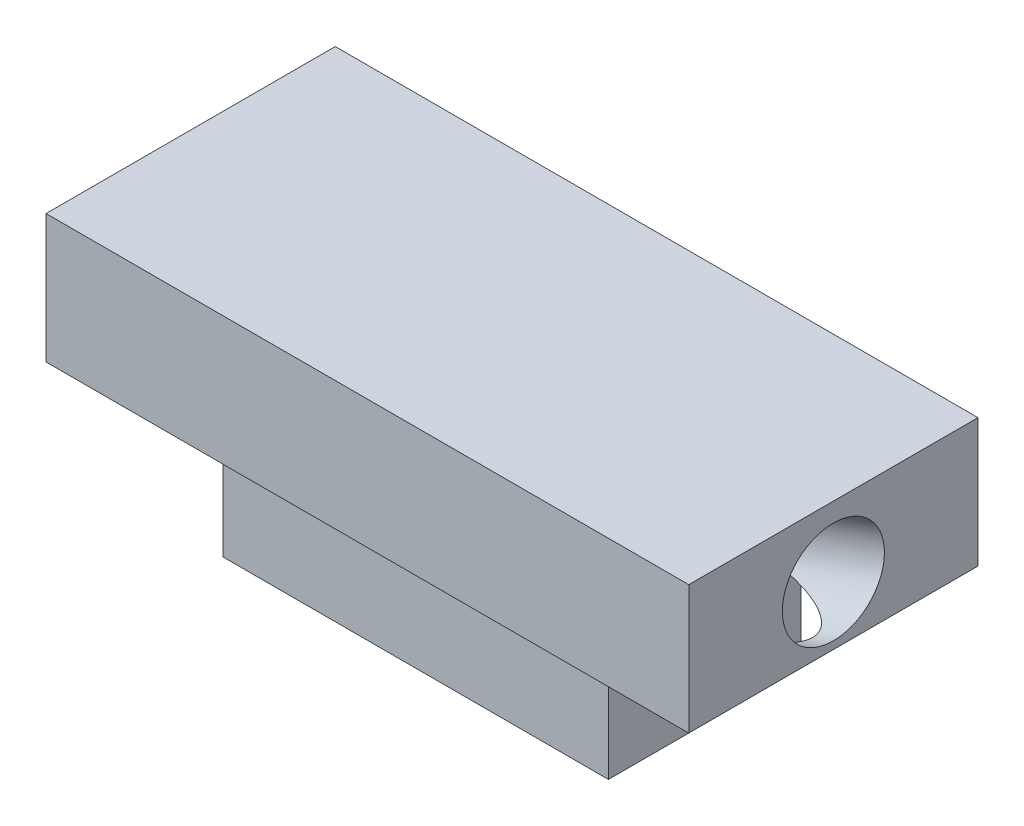
ISO-10303-21;
HEADER;
FILE_DESCRIPTION(('STEP AP214'),'2;1');
FILE_NAME('part.step','',(''),(''),'','','');
FILE_SCHEMA(('AUTOMOTIVE_DESIGN { 1 0 10303 214 1 1 1 1 }'));
ENDSEC;
DATA;
#1=APPLICATION_CONTEXT('core data for automotive mechanical design processes');
#2=APPLICATION_PROTOCOL_DEFINITION('international standard','automotive_design',2000,#1);
#3=PRODUCT_CONTEXT('',#1,'mechanical');
#4=PRODUCT('Part','Part','',(#3));
#5=PRODUCT_RELATED_PRODUCT_CATEGORY('part','',(#4));
#6=PRODUCT_DEFINITION_FORMATION('','',#4);
#7=PRODUCT_DEFINITION_CONTEXT('part definition',#1,'design');
#8=PRODUCT_DEFINITION('design','',#6,#7);
#9=PRODUCT_DEFINITION_SHAPE('','',#8);
#10=(LENGTH_UNIT() NAMED_UNIT(*) SI_UNIT(.MILLI.,.METRE.));
#11=(NAMED_UNIT(*) PLANE_ANGLE_UNIT() SI_UNIT($,.RADIAN.));
#12=(NAMED_UNIT(*) SI_UNIT($,.STERADIAN.) SOLID_ANGLE_UNIT());
#13=UNCERTAINTY_MEASURE_WITH_UNIT(LENGTH_MEASURE(1.E-05),#10,'distance_accuracy_value','');
#14=(GEOMETRIC_REPRESENTATION_CONTEXT(3) GLOBAL_UNCERTAINTY_ASSIGNED_CONTEXT((#13)) GLOBAL_UNIT_ASSIGNED_CONTEXT((#10,
#11,#12)) REPRESENTATION_CONTEXT('',''));
#15=CARTESIAN_POINT('',(0.,0.,0.));
#16=DIRECTION('',(0.,0.,1.));
#17=DIRECTION('',(1.,0.,0.));
#18=AXIS2_PLACEMENT_3D('',#15,#16,#17);
#19=CARTESIAN_POINT('',(1.96279525207454,1.,0.));
#20=DIRECTION('',(1.,0.,0.));
#21=DIRECTION('',(0.,0.,-1.));
#22=AXIS2_PLACEMENT_3D('',#19,#20,#21);
#23=PLANE('',#22);
#24=CARTESIAN_POINT('',(1.96279525207454,1.,-0.0154767733328985));
#25=CARTESIAN_POINT('',(1.96279525207454,0.978595145254475,-0.0205539611938586));
#26=CARTESIAN_POINT('',(1.96279525207454,0.957626989323549,-0.0274431017524483));
#27=CARTESIAN_POINT('',(1.96279525207454,0.917111498569788,-0.0445821701094268));
#28=CARTESIAN_POINT('',(1.96279525207454,0.897564163746954,-0.0548320979078155));
#29=CARTESIAN_POINT('',(1.96279525207454,0.860437738688272,-0.0784296225889317));
#30=CARTESIAN_POINT('',(1.96279525207454,0.842858648452425,-0.0917772194716591));
#31=CARTESIAN_POINT('',(1.96279525207454,0.810151348744959,-0.121196688677654));
#32=CARTESIAN_POINT('',(1.96279525207454,0.79502313927334,-0.137268561000922));
#33=CARTESIAN_POINT('',(1.96279525207454,0.767635452246772,-0.171694703422779));
#34=CARTESIAN_POINT('',(1.96279525207454,0.755375974691822,-0.190048973521367));
#35=CARTESIAN_POINT('',(1.96279525207454,0.734063725190147,-0.228533298985384));
#36=CARTESIAN_POINT('',(1.96279525207454,0.725010953243422,-0.248663354350813));
#37=CARTESIAN_POINT('',(1.96279525207454,0.710361845512513,-0.290144136926618));
#38=CARTESIAN_POINT('',(1.96279525207454,0.704765509728329,-0.311494864136994));
#39=CARTESIAN_POINT('',(1.96279525207454,0.697183616977229,-0.354828081782214));
#40=CARTESIAN_POINT('',(1.96279525207454,0.695198060010312,-0.376810572217058));
#41=CARTESIAN_POINT('',(1.96279525207454,0.694892493989746,-0.420801014791996));
#42=CARTESIAN_POINT('',(1.96279525207454,0.696572484936095,-0.44280896693209));
#43=CARTESIAN_POINT('',(1.96279525207454,0.703551671244175,-0.486243328585095));
#44=CARTESIAN_POINT('',(1.96279525207454,0.708850866605904,-0.507669738098005));
#45=CARTESIAN_POINT('',(1.96279525207454,0.72292232626511,-0.549350020089883));
#46=CARTESIAN_POINT('',(1.96279525207454,0.731694590562588,-0.56960389256885));
#47=CARTESIAN_POINT('',(1.96279525207454,0.752470150093908,-0.60838056603396));
#48=CARTESIAN_POINT('',(1.96279525207454,0.764473445327751,-0.626903367020103));
#49=CARTESIAN_POINT('',(1.96279525207454,0.791380324165914,-0.661706659017245));
#50=CARTESIAN_POINT('',(1.96279525207454,0.806283907770235,-0.677987150028244));
#51=CARTESIAN_POINT('',(1.96279525207454,0.838579090833126,-0.707858107068262));
#52=CARTESIAN_POINT('',(1.96279525207454,0.855970690291696,-0.72144857309728));
#53=CARTESIAN_POINT('',(1.96279525207454,0.893244552266643,-0.74587279061171));
#54=CARTESIAN_POINT('',(1.96279525207454,0.913179768841004,-0.75662578175796));
#55=CARTESIAN_POINT('',(1.96279525207454,0.955214578566607,-0.774884818970141));
#56=CARTESIAN_POINT('',(1.96279525207454,0.977361744555309,-0.782281400744075));
#57=CARTESIAN_POINT('',(1.96279525207454,1.,-0.787648226667101));
#58=B_SPLINE_CURVE_WITH_KNOTS('',3,(#24,#25,#26,#27,#28,#29,#30,#31,#32,#33,#34,#35,#36,#37,#38,
#39,#40,#41,#42,#43,#44,#45,#46,#47,#48,#49,#50,#51,#52,#53,#54,#55,#56,#57),.UNSPECIFIED.,.F.,
.F.,(4,2,2,2,2,2,2,2,2,2,2,2,2,2,2,2,4),(0.,0.0659115563194917,0.131823112638983,
0.197734668958475,0.263646225277967,0.329557781597458,0.39546933791695,0.461380894236442,
0.527292450555934,0.593204006875425,0.659115563194917,0.725027119514409,0.790938675833901,
0.856850232153392,0.922761788472884,0.990385115428013,1.06007839329385),.UNSPECIFIED.);
#59=CARTESIAN_POINT('',(1.96279525207454,1.,-0.015476773332899));
#60=VERTEX_POINT('',#59);
#61=CARTESIAN_POINT('',(1.96279525207454,1.,-0.787648226667106));
#62=VERTEX_POINT('',#61);
#63=EDGE_CURVE('E60',#60,#62,#58,.T.);
#64=ORIENTED_EDGE('',*,*,#63,.F.);
#65=DIRECTION('',(0.,0.,1.));
#66=VECTOR('',#65,1.);
#67=CARTESIAN_POINT('',(1.96279525207454,1.,0.));
#68=LINE('',#67,#66);
#69=CARTESIAN_POINT('',(1.96279525207454,1.,0.3484375));
#70=VERTEX_POINT('',#69);
#71=EDGE_CURVE('E133',#60,#70,#68,.T.);
#72=ORIENTED_EDGE('',*,*,#71,.T.);
#73=DIRECTION('',(0.,-1.,0.));
#74=VECTOR('',#73,1.);
#75=CARTESIAN_POINT('',(1.96279525207454,1.,0.3484375));
#76=LINE('',#75,#74);
#77=CARTESIAN_POINT('',(1.96279525207454,0.,0.3484375));
#78=VERTEX_POINT('',#77);
#79=EDGE_CURVE('E139',#70,#78,#76,.T.);
#80=ORIENTED_EDGE('',*,*,#79,.T.);
#81=DIRECTION('',(0.,0.,1.));
#82=VECTOR('',#81,1.);
#83=CARTESIAN_POINT('',(1.96279525207454,0.,0.));
#84=LINE('',#83,#82);
#85=CARTESIAN_POINT('',(1.96279525207454,0.,-1.1515625));
#86=VERTEX_POINT('',#85);
#87=EDGE_CURVE('E156',#86,#78,#84,.T.);
#88=ORIENTED_EDGE('',*,*,#87,.F.);
#89=DIRECTION('',(0.,-1.,0.));
#90=VECTOR('',#89,1.);
#91=CARTESIAN_POINT('',(1.96279525207454,1.,-1.1515625));
#92=LINE('',#91,#90);
#93=CARTESIAN_POINT('',(1.96279525207454,1.,-1.1515625));
#94=VERTEX_POINT('',#93);
#95=EDGE_CURVE('E47',#94,#86,#92,.T.);
#96=ORIENTED_EDGE('',*,*,#95,.F.);
#97=EDGE_CURVE('E169',#94,#62,#68,.T.);
#98=ORIENTED_EDGE('',*,*,#97,.T.);
#99=EDGE_LOOP('',(#64,#72,#80,#88,#96,#98));
#100=FACE_BOUND('',#99,.T.);
#101=ADVANCED_FACE('F35',(#100),#23,.T.);
#102=CARTESIAN_POINT('',(0.,1.,-1.1515625));
#103=DIRECTION('',(0.,0.,-1.));
#104=DIRECTION('',(-1.,0.,0.));
#105=AXIS2_PLACEMENT_3D('',#102,#103,#104);
#106=PLANE('',#105);
#107=DIRECTION('',(1.,0.,0.));
#108=VECTOR('',#107,1.);
#109=CARTESIAN_POINT('',(0.,0.,-1.1515625));
#110=LINE('',#109,#108);
#111=CARTESIAN_POINT('',(-1.03720474792546,0.,-1.1515625));
#112=VERTEX_POINT('',#111);
#113=EDGE_CURVE('E135',#112,#86,#110,.T.);
#114=ORIENTED_EDGE('',*,*,#113,.F.);
#115=DIRECTION('',(0.,-1.,0.));
#116=VECTOR('',#115,1.);
#117=CARTESIAN_POINT('',(-1.03720474792546,1.,-1.1515625));
#118=LINE('',#117,#116);
#119=CARTESIAN_POINT('',(-1.03720474792546,1.,-1.1515625));
#120=VERTEX_POINT('',#119);
#121=EDGE_CURVE('E144',#120,#112,#118,.T.);
#122=ORIENTED_EDGE('',*,*,#121,.F.);
#123=DIRECTION('',(1.,0.,0.));
#124=VECTOR('',#123,1.);
#125=CARTESIAN_POINT('',(0.,1.,-1.1515625));
#126=LINE('',#125,#124);
#127=EDGE_CURVE('E152',#120,#94,#126,.T.);
#128=ORIENTED_EDGE('',*,*,#127,.T.);
#129=ORIENTED_EDGE('',*,*,#95,.T.);
#130=EDGE_LOOP('',(#114,#122,#128,#129));
#131=FACE_BOUND('',#130,.T.);
#132=ADVANCED_FACE('F149',(#131),#106,.T.);
#133=CARTESIAN_POINT('',(-1.03720474792546,1.,0.));
#134=DIRECTION('',(-1.,0.,0.));
#135=DIRECTION('',(0.,0.,1.));
#136=AXIS2_PLACEMENT_3D('',#133,#134,#135);
#137=PLANE('',#136);
#138=CARTESIAN_POINT('',(-1.03720474792546,0.,-0.4015625));
#139=DIRECTION('',(-1.,0.,0.));
#140=DIRECTION('',(0.,0.,1.));
#141=AXIS2_PLACEMENT_3D('',#138,#139,#140);
#142=CIRCLE('',#141,0.396875);
#143=CARTESIAN_POINT('',(-1.03720474792546,0.,-0.00468750000000024));
#144=VERTEX_POINT('',#143);
#145=CARTESIAN_POINT('',(-1.03720474792546,0.,-0.7984375));
#146=VERTEX_POINT('',#145);
#147=EDGE_CURVE('E53',#144,#146,#142,.T.);
#148=ORIENTED_EDGE('',*,*,#147,.F.);
#149=DIRECTION('',(0.,0.,-1.));
#150=VECTOR('',#149,1.);
#151=CARTESIAN_POINT('',(-1.03720474792546,0.,0.));
#152=LINE('',#151,#150);
#153=CARTESIAN_POINT('',(-1.03720474792546,0.,0.3484375));
#154=VERTEX_POINT('',#153);
#155=EDGE_CURVE('E123',#154,#144,#152,.T.);
#156=ORIENTED_EDGE('',*,*,#155,.F.);
#157=DIRECTION('',(0.,-1.,0.));
#158=VECTOR('',#157,1.);
#159=CARTESIAN_POINT('',(-1.03720474792546,1.,0.3484375));
#160=LINE('',#159,#158);
#161=CARTESIAN_POINT('',(-1.03720474792546,1.,0.3484375));
#162=VERTEX_POINT('',#161);
#163=EDGE_CURVE('E141',#162,#154,#160,.T.);
#164=ORIENTED_EDGE('',*,*,#163,.F.);
#165=DIRECTION('',(0.,0.,-1.));
#166=VECTOR('',#165,1.);
#167=CARTESIAN_POINT('',(-1.03720474792546,1.,0.));
#168=LINE('',#167,#166);
#169=EDGE_CURVE('E161',#162,#120,#168,.T.);
#170=ORIENTED_EDGE('',*,*,#169,.T.);
#171=ORIENTED_EDGE('',*,*,#121,.T.);
#172=EDGE_CURVE('E125',#146,#112,#152,.T.);
#173=ORIENTED_EDGE('',*,*,#172,.F.);
#174=EDGE_LOOP('',(#148,#156,#164,#170,#171,#173));
#175=FACE_BOUND('',#174,.T.);
#176=ADVANCED_FACE('F122',(#175),#137,.T.);
#177=CARTESIAN_POINT('',(0.,1.,0.3484375));
#178=DIRECTION('',(0.,0.,-1.));
#179=DIRECTION('',(-1.,0.,0.));
#180=AXIS2_PLACEMENT_3D('',#177,#178,#179);
#181=PLANE('',#180);
#182=DIRECTION('',(1.,0.,0.));
#183=VECTOR('',#182,1.);
#184=CARTESIAN_POINT('',(0.,0.,0.3484375));
#185=LINE('',#184,#183);
#186=EDGE_CURVE('E131',#154,#78,#185,.T.);
#187=ORIENTED_EDGE('',*,*,#186,.T.);
#188=ORIENTED_EDGE('',*,*,#79,.F.);
#189=DIRECTION('',(1.,0.,0.));
#190=VECTOR('',#189,1.);
#191=CARTESIAN_POINT('',(0.,1.,0.3484375));
#192=LINE('',#191,#190);
#193=EDGE_CURVE('E142',#162,#70,#192,.T.);
#194=ORIENTED_EDGE('',*,*,#193,.F.);
#195=ORIENTED_EDGE('',*,*,#163,.T.);
#196=EDGE_LOOP('',(#187,#188,#194,#195));
#197=FACE_BOUND('',#196,.T.);
#198=ADVANCED_FACE('F175',(#197),#181,.F.);
#199=CARTESIAN_POINT('',(0.,0.,0.));
#200=DIRECTION('',(0.,1.,0.));
#201=DIRECTION('',(0.,0.,1.));
#202=AXIS2_PLACEMENT_3D('',#199,#200,#201);
#203=PLANE('',#202);
#204=ORIENTED_EDGE('',*,*,#155,.T.);
#205=CARTESIAN_POINT('',(-1.03720474792546,0.,-0.00468750000000024));
#206=CARTESIAN_POINT('',(-1.00798517608305,-2.96002296076373E-13,-0.00468945213929233));
#207=CARTESIAN_POINT('',(-0.978766847241268,-1.48085127005117E-13,-0.00511477325799606));
#208=CARTESIAN_POINT('',(-0.920350962781518,1.48108585599991E-13,-0.00682851523929372));
#209=CARTESIAN_POINT('',(-0.891153411187517,2.96385182351466E-13,-0.00811707281735047));
#210=CARTESIAN_POINT('',(-0.803641153818702,-5.90088268085509E-13,-0.0133014844389323));
#211=CARTESIAN_POINT('',(-0.745398920597326,-2.95574097082653E-12,-0.018516069103826));
#212=CARTESIAN_POINT('',(-0.629363190188414,3.27019302753786E-12,-0.0328163919568976));
#213=CARTESIAN_POINT('',(-0.57156976165132,1.18634240632029E-11,-0.0419027109463507));
#214=CARTESIAN_POINT('',(-0.485551871202785,6.55079652541903E-12,-0.0590198320747073));
#215=CARTESIAN_POINT('',(-0.45697817621558,1.73970937557243E-12,-0.0653105438313019));
#216=CARTESIAN_POINT('',(-0.400166751611927,-1.73875327573029E-12,-0.079219383582597));
#217=CARTESIAN_POINT('',(-0.371928845987663,-4.09503751100553E-13,-0.0868367801632373));
#218=CARTESIAN_POINT('',(-0.322367542930738,3.14439446119949E-13,-0.101696545406016));
#219=CARTESIAN_POINT('',(-0.300949241740913,0.,-0.108621361935436));
#220=CARTESIAN_POINT('',(-0.258456521429277,0.,-0.123557784999515));
#221=CARTESIAN_POINT('',(-0.237382647370862,0.,-0.131570956504203));
#222=CARTESIAN_POINT('',(-0.188427107705168,0.,-0.151932505448543));
#223=CARTESIAN_POINT('',(-0.160763374930295,0.,-0.164813500144862));
#224=CARTESIAN_POINT('',(-0.107104110852088,0.,-0.19368063580326));
#225=CARTESIAN_POINT('',(-0.0811043523904628,0.,-0.209658456225708));
#226=CARTESIAN_POINT('',(-0.0456550027179548,0.,-0.236190726238898));
#227=CARTESIAN_POINT('',(-0.0348983125289128,0.,-0.244965113486659));
#228=CARTESIAN_POINT('',(-0.0144038328268623,0.,-0.263619711472658));
#229=CARTESIAN_POINT('',(-0.00466673146018892,0.,-0.273500659866471));
#230=CARTESIAN_POINT('',(0.019608648552244,0.,-0.3020441226873));
#231=CARTESIAN_POINT('',(0.0328024780422433,0.,-0.322049527164613));
#232=CARTESIAN_POINT('',(0.0448178336849452,0.,-0.351790765314338));
#233=CARTESIAN_POINT('',(0.0474465171367264,0.,-0.359986353606202));
#234=CARTESIAN_POINT('',(0.051301766044785,0.,-0.376701956049104));
#235=CARTESIAN_POINT('',(0.0525298703374297,0.,-0.38522160349173));
#236=CARTESIAN_POINT('',(0.0534534355793349,0.,-0.402374318421165));
#237=CARTESIAN_POINT('',(0.0531437622522981,0.,-0.41100766974588));
#238=CARTESIAN_POINT('',(0.0510166446566873,0.,-0.42808657074982));
#239=CARTESIAN_POINT('',(0.0491981066584331,0.,-0.436531979634139));
#240=CARTESIAN_POINT('',(0.0437067618747205,0.,-0.45478008546776));
#241=CARTESIAN_POINT('',(0.0397208129317433,0.,-0.464487291899254));
#242=CARTESIAN_POINT('',(0.0302354716333218,0.,-0.4831428579508));
#243=CARTESIAN_POINT('',(0.0247312661801371,0.,-0.4920886838473));
#244=CARTESIAN_POINT('',(0.00894026617660431,0.,-0.514387357906329));
#245=CARTESIAN_POINT('',(-0.00222004801774035,0.,-0.527114122014195));
#246=CARTESIAN_POINT('',(-0.0262464403315027,0.,-0.550814516707526));
#247=CARTESIAN_POINT('',(-0.0391166597988291,0.,-0.561783743590182));
#248=CARTESIAN_POINT('',(-0.0663017231203313,0.,-0.582583053585265));
#249=CARTESIAN_POINT('',(-0.0806467261380129,0.,-0.592373122215812));
#250=CARTESIAN_POINT('',(-0.110094786714029,0.,-0.610743089219357));
#251=CARTESIAN_POINT('',(-0.125198494822779,0.,-0.61932192415212));
#252=CARTESIAN_POINT('',(-0.168020919987602,0.,-0.641850372426641));
#253=CARTESIAN_POINT('',(-0.196309976182764,0.,-0.654711207412755));
#254=CARTESIAN_POINT('',(-0.253852111615501,0.,-0.678081588445783));
#255=CARTESIAN_POINT('',(-0.283106407926561,0.,-0.688588024862351));
#256=CARTESIAN_POINT('',(-0.342094790488592,0.,-0.707677645531083));
#257=CARTESIAN_POINT('',(-0.371826353486208,1.44648450418598E-13,-0.716268702092348));
#258=CARTESIAN_POINT('',(-0.431697150691973,-1.44686888607635E-13,-0.731893495946344));
#259=CARTESIAN_POINT('',(-0.461836491133223,-5.4001573606243E-13,-0.738926818797824));
#260=CARTESIAN_POINT('',(-0.552606568064764,1.07743111535878E-12,-0.758002706137492));
#261=CARTESIAN_POINT('',(-0.613660913214167,5.88593987746538E-12,-0.768042958866966));
#262=CARTESIAN_POINT('',(-0.73490252746628,5.84816568710147E-12,-0.783577230997017));
#263=CARTESIAN_POINT('',(-0.795077789540393,1.21969861670087E-12,-0.789169765906921));
#264=CARTESIAN_POINT('',(-0.885632100526563,-5.56445453384898E-13,-0.794742763469694));
#265=CARTESIAN_POINT('',(-0.915930447051045,-2.81249715402848E-13,-0.796131060710575));
#266=CARTESIAN_POINT('',(-0.976553704962862,2.81232375635393E-13,-0.797977240012193));
#267=CARTESIAN_POINT('',(-1.00687861459724,5.68517982228075E-13,-0.798435179430137));
#268=CARTESIAN_POINT('',(-1.03720474792546,0.,-0.7984375));
#269=B_SPLINE_CURVE_WITH_KNOTS('',3,(#205,#206,#207,#208,#209,#210,#211,#212,#213,#214,#215,
#216,#217,#218,#219,#220,#221,#222,#223,#224,#225,#226,#227,#228,#229,#230,#231,#232,#233,#234,
#235,#236,#237,#238,#239,#240,#241,#242,#243,#244,#245,#246,#247,#248,#249,#250,#251,#252,#253,
#254,#255,#256,#257,#258,#259,#260,#261,#262,#263,#264,#265,#266,#267,#268),.UNSPECIFIED.,.F.,
.F.,(4,2,2,2,2,2,2,2,2,2,2,2,2,2,2,2,2,2,2,2,2,2,2,2,2,2,2,2,2,2,2,4),(0.,0.087652935717456,
0.175319756790924,0.350629663159841,0.525965877140368,0.613715484466894,0.701416866850282,
0.768923170835512,0.836527592104288,0.927955168635286,1.01914042045048,1.06070592672641,
1.10229930820702,1.17269503643033,1.19841393316187,1.22410454486697,1.24988098901318,
1.2756761340527,1.30698210539703,1.33838848508257,1.38888316541807,1.43950245133819,
1.49152515532431,1.54359325394934,1.6366524939452,1.7298339291622,1.82262501872576,
1.91544076615072,2.10084876058277,2.28202579218256,2.37300365667309,2.46397591214457),.UNSPECIFIED.);
#270=EDGE_CURVE('E112',#144,#146,#269,.T.);
#271=ORIENTED_EDGE('',*,*,#270,.T.);
#272=ORIENTED_EDGE('',*,*,#172,.T.);
#273=ORIENTED_EDGE('',*,*,#113,.T.);
#274=ORIENTED_EDGE('',*,*,#87,.T.);
#275=ORIENTED_EDGE('',*,*,#186,.F.);
#276=EDGE_LOOP('',(#204,#271,#272,#273,#274,#275));
#277=FACE_BOUND('',#276,.T.);
#278=ADVANCED_FACE('F128',(#277),#203,.F.);
#279=CARTESIAN_POINT('',(-2.03720474792546,2.,-1.5265625));
#280=DIRECTION('',(1.,0.,0.));
#281=DIRECTION('',(0.,0.,-1.));
#282=AXIS2_PLACEMENT_3D('',#279,#280,#281);
#283=PLANE('',#282);
#284=DIRECTION('',(0.,0.,1.));
#285=VECTOR('',#284,1.);
#286=CARTESIAN_POINT('',(-2.03720474792546,1.,-1.5265625));
#287=LINE('',#286,#285);
#288=CARTESIAN_POINT('',(-2.03720474792546,1.,-1.5265625));
#289=VERTEX_POINT('',#288);
#290=CARTESIAN_POINT('',(-2.03720474792546,1.,0.7234375));
#291=VERTEX_POINT('',#290);
#292=EDGE_CURVE('E117',#289,#291,#287,.T.);
#293=ORIENTED_EDGE('',*,*,#292,.T.);
#294=DIRECTION('',(0.,-1.,0.));
#295=VECTOR('',#294,1.);
#296=CARTESIAN_POINT('',(-2.03720474792546,2.,0.7234375));
#297=LINE('',#296,#295);
#298=CARTESIAN_POINT('',(-2.03720474792546,2.,0.7234375));
#299=VERTEX_POINT('',#298);
#300=EDGE_CURVE('E158',#299,#291,#297,.T.);
#301=ORIENTED_EDGE('',*,*,#300,.F.);
#302=DIRECTION('',(0.,0.,1.));
#303=VECTOR('',#302,1.);
#304=CARTESIAN_POINT('',(-2.03720474792546,2.,-1.5265625));
#305=LINE('',#304,#303);
#306=CARTESIAN_POINT('',(-2.03720474792546,2.,-1.5265625));
#307=VERTEX_POINT('',#306);
#308=EDGE_CURVE('E293',#307,#299,#305,.T.);
#309=ORIENTED_EDGE('',*,*,#308,.F.);
#310=DIRECTION('',(0.,-1.,0.));
#311=VECTOR('',#310,1.);
#312=CARTESIAN_POINT('',(-2.03720474792546,2.,-1.5265625));
#313=LINE('',#312,#311);
#314=EDGE_CURVE('E280',#307,#289,#313,.T.);
#315=ORIENTED_EDGE('',*,*,#314,.T.);
#316=EDGE_LOOP('',(#293,#301,#309,#315));
#317=FACE_BOUND('',#316,.T.);
#318=ADVANCED_FACE('F182',(#317),#283,.F.);
#319=CARTESIAN_POINT('',(-2.03720474792546,2.,0.7234375));
#320=DIRECTION('',(0.,0.,-1.));
#321=DIRECTION('',(-1.,0.,0.));
#322=AXIS2_PLACEMENT_3D('',#319,#320,#321);
#323=PLANE('',#322);
#324=DIRECTION('',(1.,0.,0.));
#325=VECTOR('',#324,1.);
#326=CARTESIAN_POINT('',(-2.03720474792546,1.,0.7234375));
#327=LINE('',#326,#325);
#328=CARTESIAN_POINT('',(2.96279525207454,1.,0.723437499999998));
#329=VERTEX_POINT('',#328);
#330=EDGE_CURVE('E282',#291,#329,#327,.T.);
#331=ORIENTED_EDGE('',*,*,#330,.T.);
#332=DIRECTION('',(0.,-1.,0.));
#333=VECTOR('',#332,1.);
#334=CARTESIAN_POINT('',(2.96279525207454,2.,0.723437499999998));
#335=LINE('',#334,#333);
#336=CARTESIAN_POINT('',(2.96279525207454,2.,0.723437499999998));
#337=VERTEX_POINT('',#336);
#338=EDGE_CURVE('E298',#337,#329,#335,.T.);
#339=ORIENTED_EDGE('',*,*,#338,.F.);
#340=DIRECTION('',(1.,0.,0.));
#341=VECTOR('',#340,1.);
#342=CARTESIAN_POINT('',(-2.03720474792546,2.,0.7234375));
#343=LINE('',#342,#341);
#344=EDGE_CURVE('E301',#299,#337,#343,.T.);
#345=ORIENTED_EDGE('',*,*,#344,.F.);
#346=ORIENTED_EDGE('',*,*,#300,.T.);
#347=EDGE_LOOP('',(#331,#339,#345,#346));
#348=FACE_BOUND('',#347,.T.);
#349=ADVANCED_FACE('F218',(#348),#323,.F.);
#350=CARTESIAN_POINT('',(2.96279525207454,2.,-1.5265625));
#351=DIRECTION('',(-1.,0.,0.));
#352=DIRECTION('',(0.,0.,1.));
#353=AXIS2_PLACEMENT_3D('',#350,#351,#352);
#354=PLANE('',#353);
#355=CARTESIAN_POINT('',(2.96279525207454,1.45588093706483,-0.00468750000000024));
#356=CARTESIAN_POINT('',(2.96279525207454,1.47786336587049,-0.00468857393104689));
#357=CARTESIAN_POINT('',(2.96279525207454,1.49986887246744,-0.00652060494220236));
#358=CARTESIAN_POINT('',(2.96279525207454,1.5432608455754,-0.0138007465701321));
#359=CARTESIAN_POINT('',(2.96279525207454,1.56464731208641,-0.0192488571869063));
#360=CARTESIAN_POINT('',(2.96279525207454,1.6062269463184,-0.0336096336210275));
#361=CARTESIAN_POINT('',(2.96279525207454,1.62642011403938,-0.0425222994383744));
#362=CARTESIAN_POINT('',(2.96279525207454,1.66505201325784,-0.0635666999566186));
#363=CARTESIAN_POINT('',(2.96279525207454,1.68349074475532,-0.0756984346575157));
#364=CARTESIAN_POINT('',(2.96279525207454,1.71810632695178,-0.102846272894612));
#365=CARTESIAN_POINT('',(2.96279525207454,1.73428317765075,-0.11786237643081));
#366=CARTESIAN_POINT('',(2.96279525207454,1.76392851845161,-0.150364812012463));
#367=CARTESIAN_POINT('',(2.96279525207454,1.7773970085535,-0.167851144057916));
#368=CARTESIAN_POINT('',(2.96279525207454,1.8012542293724,-0.204811733386054));
#369=CARTESIAN_POINT('',(2.96279525207454,1.81164296008942,-0.224285990668738));
#370=CARTESIAN_POINT('',(2.96279525207454,1.82905410527651,-0.264685305744417));
#371=CARTESIAN_POINT('',(2.96279525207454,1.83607651974658,-0.285610363537413));
#372=CARTESIAN_POINT('',(2.96279525207454,1.8465613504881,-0.328334137654976));
#373=CARTESIAN_POINT('',(2.96279525207454,1.85002376675956,-0.350132853979543));
#374=CARTESIAN_POINT('',(2.96279525207454,1.85329310141274,-0.394002707083044));
#375=CARTESIAN_POINT('',(2.96279525207454,1.85310001979447,-0.416073843861978));
#376=CARTESIAN_POINT('',(2.96279525207454,1.84906368453622,-0.459879785912696));
#377=CARTESIAN_POINT('',(2.96279525207454,1.84522043089624,-0.48161459118448));
#378=CARTESIAN_POINT('',(2.96279525207454,1.83398975363851,-0.524148394781524));
#379=CARTESIAN_POINT('',(2.96279525207454,1.82660233002077,-0.544947393106783));
#380=CARTESIAN_POINT('',(2.96279525207454,1.80848706801382,-0.585035918186588));
#381=CARTESIAN_POINT('',(2.96279525207454,1.79775922962463,-0.604325444941133));
#382=CARTESIAN_POINT('',(2.96279525207454,1.77325902641951,-0.640862995534358));
#383=CARTESIAN_POINT('',(2.96279525207454,1.75948666160358,-0.658111019373038));
#384=CARTESIAN_POINT('',(2.96279525207454,1.72927726607357,-0.690089840211637));
#385=CARTESIAN_POINT('',(2.96279525207454,1.71284023535949,-0.704820637211555));
#386=CARTESIAN_POINT('',(2.96279525207454,1.67775486366351,-0.731358708984915));
#387=CARTESIAN_POINT('',(2.96279525207454,1.65910652268161,-0.743165983758356));
#388=CARTESIAN_POINT('',(2.96279525207454,1.6201128770215,-0.763531350404549));
#389=CARTESIAN_POINT('',(2.96279525207454,1.59976757234329,-0.772089442277301));
#390=CARTESIAN_POINT('',(2.96279525207454,1.55794115042536,-0.785720399325172));
#391=CARTESIAN_POINT('',(2.96279525207454,1.53646003318563,-0.79079326450029));
#392=CARTESIAN_POINT('',(2.96279525207454,1.49295446453252,-0.797313851641693));
#393=CARTESIAN_POINT('',(2.96279525207454,1.47093001311915,-0.798761573607978));
#394=CARTESIAN_POINT('',(2.96279525207454,1.42694524040105,-0.797991944193675));
#395=CARTESIAN_POINT('',(2.96279525207454,1.40498491909632,-0.795774592813087));
#396=CARTESIAN_POINT('',(2.96279525207454,1.36173410208232,-0.78773597426759));
#397=CARTESIAN_POINT('',(2.96279525207454,1.34044360637305,-0.781914707102682));
#398=CARTESIAN_POINT('',(2.96279525207454,1.29911966133712,-0.766828815443055));
#399=CARTESIAN_POINT('',(2.96279525207454,1.27908621201047,-0.757564190948336));
#400=CARTESIAN_POINT('',(2.96279525207454,1.24082890948045,-0.73584711555533));
#401=CARTESIAN_POINT('',(2.96279525207454,1.22260505627708,-0.723394664657042));
#402=CARTESIAN_POINT('',(2.96279525207454,1.18846958461562,-0.69564539196483));
#403=CARTESIAN_POINT('',(2.96279525207454,1.17255796615752,-0.680348570170905));
#404=CARTESIAN_POINT('',(2.96279525207454,1.14348582803366,-0.647332462807859));
#405=CARTESIAN_POINT('',(2.96279525207454,1.1303253083679,-0.629613177238737));
#406=CARTESIAN_POINT('',(2.96279525207454,1.1071183528358,-0.592240864286144));
#407=CARTESIAN_POINT('',(2.96279525207454,1.09707191696947,-0.572587836902672));
#408=CARTESIAN_POINT('',(2.96279525207454,1.08037022337867,-0.531890097509859));
#409=CARTESIAN_POINT('',(2.96279525207454,1.07371496565419,-0.510845385500519));
#410=CARTESIAN_POINT('',(2.96279525207454,1.06397918940605,-0.467944718588695));
#411=CARTESIAN_POINT('',(2.96279525207454,1.0608986708824,-0.446088763686212));
#412=CARTESIAN_POINT('',(2.96279525207454,1.05839733787523,-0.402168427930869));
#413=CARTESIAN_POINT('',(2.96279525207454,1.05897652339172,-0.380104047078011));
#414=CARTESIAN_POINT('',(2.96279525207454,1.06377862391088,-0.336375424926245));
#415=CARTESIAN_POINT('',(2.96279525207454,1.06800153891356,-0.314711183627338));
#416=CARTESIAN_POINT('',(2.96279525207454,1.07997462404255,-0.272380370103086));
#417=CARTESIAN_POINT('',(2.96279525207454,1.08772479416886,-0.251713797877741));
#418=CARTESIAN_POINT('',(2.96279525207454,1.10653863168384,-0.211948333430914));
#419=CARTESIAN_POINT('',(2.96279525207454,1.1176022990725,-0.192849441209432));
#420=CARTESIAN_POINT('',(2.96279525207454,1.14273797134456,-0.156746114634508));
#421=CARTESIAN_POINT('',(2.96279525207454,1.15680997622796,-0.139741680281066));
#422=CARTESIAN_POINT('',(2.96279525207454,1.18757423130644,-0.108296258125058));
#423=CARTESIAN_POINT('',(2.96279525207454,1.20426648150151,-0.0938552703224931));
#424=CARTESIAN_POINT('',(2.96279525207454,1.23981070977398,-0.067935105691245));
#425=CARTESIAN_POINT('',(2.96279525207454,1.25866268785137,-0.0564559288625621));
#426=CARTESIAN_POINT('',(2.96279525207454,1.29800686590022,-0.0367757647113801));
#427=CARTESIAN_POINT('',(2.96279525207454,1.31849906587168,-0.028574777388881));
#428=CARTESIAN_POINT('',(2.96279525207454,1.35813926655676,-0.0164193695674087));
#429=CARTESIAN_POINT('',(2.96279525207454,1.37717096997597,-0.0120851424471143));
#430=CARTESIAN_POINT('',(2.96279525207454,1.40621710770947,-0.00768188943716943));
#431=CARTESIAN_POINT('',(2.96279525207454,1.41608188368344,-0.00656356551846243));
#432=CARTESIAN_POINT('',(2.96279525207454,1.4359229560144,-0.00506401615560013));
#433=CARTESIAN_POINT('',(2.96279525207454,1.44589956754662,-0.00468701236950643));
#434=CARTESIAN_POINT('',(2.96279525207454,1.45588093706483,-0.00468750000000024));
#435=B_SPLINE_CURVE_WITH_KNOTS('',3,(#355,#356,#357,#358,#359,#360,#361,#362,#363,#364,#365,
#366,#367,#368,#369,#370,#371,#372,#373,#374,#375,#376,#377,#378,#379,#380,#381,#382,#383,#384,
#385,#386,#387,#388,#389,#390,#391,#392,#393,#394,#395,#396,#397,#398,#399,#400,#401,#402,#403,
#404,#405,#406,#407,#408,#409,#410,#411,#412,#413,#414,#415,#416,#417,#418,#419,#420,#421,#422,
#423,#424,#425,#426,#427,#428,#429,#430,#431,#432,#433,#434),.UNSPECIFIED.,.T.,.F.,(4,2,2,2,2,2,
2,2,2,2,2,2,2,2,2,2,2,2,2,2,2,2,2,2,2,2,2,2,2,2,2,2,2,2,2,2,2,2,2,4),(0.,0.0659115563194917,
0.131823112638983,0.197734668958475,0.263646225277966,0.329557781597458,0.395469337916949,
0.461380894236441,0.527292450555933,0.593204006875424,0.659115563194915,0.725027119514407,
0.790938675833898,0.85685023215339,0.922761788472881,0.988673344792372,1.05458490111186,
1.12049645743136,1.18640801375085,1.25231957007034,1.31823112638983,1.38414268270932,
1.45005423902881,1.5159657953483,1.5818773516678,1.64778890798729,1.71370046430678,
1.77961202062627,1.84552357694576,1.91143513326525,1.97734668958474,2.04325824590423,
2.10916980222373,2.17508135854322,2.24099291486271,2.3069044711822,2.37281602750169,
2.43115028185341,2.46090918149337,2.49083706639458),.UNSPECIFIED.);
#436=CARTESIAN_POINT('',(2.96279525207454,1.45588093706483,-0.00468750000000024));
#437=VERTEX_POINT('',#436);
#438=EDGE_CURVE('E118',#437,#437,#435,.T.);
#439=ORIENTED_EDGE('',*,*,#438,.T.);
#440=EDGE_LOOP('',(#439));
#441=FACE_BOUND('',#440,.T.);
#442=DIRECTION('',(0.,0.,-1.));
#443=VECTOR('',#442,1.);
#444=CARTESIAN_POINT('',(2.96279525207454,1.,-1.5265625));
#445=LINE('',#444,#443);
#446=CARTESIAN_POINT('',(2.96279525207454,1.,-1.5265625));
#447=VERTEX_POINT('',#446);
#448=EDGE_CURVE('E284',#329,#447,#445,.T.);
#449=ORIENTED_EDGE('',*,*,#448,.T.);
#450=DIRECTION('',(0.,-1.,0.));
#451=VECTOR('',#450,1.);
#452=CARTESIAN_POINT('',(2.96279525207454,2.,-1.5265625));
#453=LINE('',#452,#451);
#454=CARTESIAN_POINT('',(2.96279525207454,2.,-1.5265625));
#455=VERTEX_POINT('',#454);
#456=EDGE_CURVE('E295',#455,#447,#453,.T.);
#457=ORIENTED_EDGE('',*,*,#456,.F.);
#458=DIRECTION('',(0.,0.,-1.));
#459=VECTOR('',#458,1.);
#460=CARTESIAN_POINT('',(2.96279525207454,2.,-1.5265625));
#461=LINE('',#460,#459);
#462=EDGE_CURVE('E305',#337,#455,#461,.T.);
#463=ORIENTED_EDGE('',*,*,#462,.F.);
#464=ORIENTED_EDGE('',*,*,#338,.T.);
#465=EDGE_LOOP('',(#449,#457,#463,#464));
#466=FACE_BOUND('',#465,.T.);
#467=ADVANCED_FACE('F212',(#441,#466),#354,.F.);
#468=CARTESIAN_POINT('',(-2.03720474792546,2.,-1.5265625));
#469=DIRECTION('',(0.,0.,1.));
#470=DIRECTION('',(1.,0.,0.));
#471=AXIS2_PLACEMENT_3D('',#468,#469,#470);
#472=PLANE('',#471);
#473=DIRECTION('',(-1.,0.,0.));
#474=VECTOR('',#473,1.);
#475=CARTESIAN_POINT('',(-2.03720474792546,1.,-1.5265625));
#476=LINE('',#475,#474);
#477=EDGE_CURVE('E291',#447,#289,#476,.T.);
#478=ORIENTED_EDGE('',*,*,#477,.T.);
#479=ORIENTED_EDGE('',*,*,#314,.F.);
#480=DIRECTION('',(-1.,0.,0.));
#481=VECTOR('',#480,1.);
#482=CARTESIAN_POINT('',(-2.03720474792546,2.,-1.5265625));
#483=LINE('',#482,#481);
#484=EDGE_CURVE('E287',#455,#307,#483,.T.);
#485=ORIENTED_EDGE('',*,*,#484,.F.);
#486=ORIENTED_EDGE('',*,*,#456,.T.);
#487=EDGE_LOOP('',(#478,#479,#485,#486));
#488=FACE_BOUND('',#487,.T.);
#489=ADVANCED_FACE('F217',(#488),#472,.F.);
#490=CARTESIAN_POINT('',(0.,2.,0.));
#491=DIRECTION('',(0.,1.,0.));
#492=DIRECTION('',(0.,0.,1.));
#493=AXIS2_PLACEMENT_3D('',#490,#491,#492);
#494=PLANE('',#493);
#495=ORIENTED_EDGE('',*,*,#308,.T.);
#496=ORIENTED_EDGE('',*,*,#344,.T.);
#497=ORIENTED_EDGE('',*,*,#462,.T.);
#498=ORIENTED_EDGE('',*,*,#484,.T.);
#499=EDGE_LOOP('',(#495,#496,#497,#498));
#500=FACE_BOUND('',#499,.T.);
#501=ADVANCED_FACE('F232',(#500),#494,.T.);
#502=CARTESIAN_POINT('',(0.,1.,0.));
#503=DIRECTION('',(0.,1.,0.));
#504=DIRECTION('',(0.,0.,1.));
#505=AXIS2_PLACEMENT_3D('',#502,#503,#504);
#506=PLANE('',#505);
#507=ORIENTED_EDGE('',*,*,#71,.F.);
#508=CARTESIAN_POINT('',(1.71027267152913,1.,-0.00468750000000024));
#509=CARTESIAN_POINT('',(1.73948319133194,0.99999999999979,-0.00468966282976006));
#510=CARTESIAN_POINT('',(1.76868885515832,0.999999999999955,-0.00511545088176333));
#511=CARTESIAN_POINT('',(1.85629744519431,1.00000000000009,-0.007681671033963));
#512=CARTESIAN_POINT('',(1.91467188610014,0.999999999999692,-0.0111115518574701));
#513=CARTESIAN_POINT('',(2.03109371600324,1.00000000000033,-0.0216270640404179));
#514=CARTESIAN_POINT('',(2.08914107383042,1.00000000000136,-0.0287130380521133));
#515=CARTESIAN_POINT('',(2.20462106496732,1.00000000000132,-0.0470699631488457));
#516=CARTESIAN_POINT('',(2.26205355045086,1.00000000000024,-0.0583418983558227));
#517=CARTESIAN_POINT('',(2.34727271662809,0.999999999999879,-0.0792123135718168));
#518=CARTESIAN_POINT('',(2.37554572620404,0.999999999999968,-0.0868369859217173));
#519=CARTESIAN_POINT('',(2.43160375323639,1.00000000000003,-0.103642520013665));
#520=CARTESIAN_POINT('',(2.45938925287245,1.00000000000001,-0.112821735832662));
#521=CARTESIAN_POINT('',(2.50301862442594,0.999999999999995,-0.128932716245334));
#522=CARTESIAN_POINT('',(2.51909153031818,0.999999999999995,-0.135244716235574));
#523=CARTESIAN_POINT('',(2.55095126004748,1.,-0.14865262641039));
#524=CARTESIAN_POINT('',(2.56673736901017,1.00000000000001,-0.155750246948466));
#525=CARTESIAN_POINT('',(2.60777063384175,0.999999999999979,-0.175639342106032));
#526=CARTESIAN_POINT('',(2.63265845394786,0.999999999999899,-0.189183928192242));
#527=CARTESIAN_POINT('',(2.6803831691636,1.0000000000001,-0.219509029338245));
#528=CARTESIAN_POINT('',(2.70322846075371,1.00000000000038,-0.236275310673595));
#529=CARTESIAN_POINT('',(2.73233391656872,1.00000000000017,-0.263025467747237));
#530=CARTESIAN_POINT('',(2.74035124546776,1.00000000000005,-0.271080448108463));
#531=CARTESIAN_POINT('',(2.7554331232809,0.999999999999953,-0.288071492267513));
#532=CARTESIAN_POINT('',(2.76249652079158,0.999999999999987,-0.297008598683088));
#533=CARTESIAN_POINT('',(2.77535419702849,1.00000000000001,-0.315961125165353));
#534=CARTESIAN_POINT('',(2.78112910306501,1.,-0.325990014189552));
#535=CARTESIAN_POINT('',(2.79068805831776,0.999999999999997,-0.346935966127103));
#536=CARTESIAN_POINT('',(2.79448160212047,1.,-0.357848498339926));
#537=CARTESIAN_POINT('',(2.7988389966927,1.,-0.377132304552074));
#538=CARTESIAN_POINT('',(2.80000739998072,1.,-0.385367067556085));
#539=CARTESIAN_POINT('',(2.80091373477573,1.,-0.401915634012142));
#540=CARTESIAN_POINT('',(2.80065219890574,1.,-0.410229406882903));
#541=CARTESIAN_POINT('',(2.79872885360691,0.999999999999999,-0.426664668379637));
#542=CARTESIAN_POINT('',(2.79707107129286,0.999999999999996,-0.43478664101838));
#543=CARTESIAN_POINT('',(2.79251709290855,1.,-0.450684469046985));
#544=CARTESIAN_POINT('',(2.78961829107144,1.00000000000002,-0.458459557940445));
#545=CARTESIAN_POINT('',(2.78114960711176,1.00000000000002,-0.477192415221896));
#546=CARTESIAN_POINT('',(2.77496593173895,1.00000000000001,-0.487870929527729));
#547=CARTESIAN_POINT('',(2.76102369085244,0.999999999999994,-0.508133793917422));
#548=CARTESIAN_POINT('',(2.75326158775349,0.999999999999998,-0.517715609323936));
#549=CARTESIAN_POINT('',(2.73015733197521,1.,-0.543012352871472));
#550=CARTESIAN_POINT('',(2.7136441714402,1.,-0.557644711737033));
#551=CARTESIAN_POINT('',(2.67879413702392,0.999999999999999,-0.584494918598964));
#552=CARTESIAN_POINT('',(2.66045271746705,1.,-0.596706510748915));
#553=CARTESIAN_POINT('',(2.62030222214733,1.,-0.62070135513807));
#554=CARTESIAN_POINT('',(2.59834717922215,1.,-0.632237468136313));
#555=CARTESIAN_POINT('',(2.55357761900957,1.,-0.653509633402591));
#556=CARTESIAN_POINT('',(2.53076226026744,1.,-0.663243865275062));
#557=CARTESIAN_POINT('',(2.46166257311296,1.,-0.690222123970636));
#558=CARTESIAN_POINT('',(2.41454976901887,1.,-0.705336235497921));
#559=CARTESIAN_POINT('',(2.31919197795792,1.,-0.731499326804941));
#560=CARTESIAN_POINT('',(2.2709453284048,1.,-0.74254188211096));
#561=CARTESIAN_POINT('',(2.17379847023772,1.,-0.761351132398948));
#562=CARTESIAN_POINT('',(2.1248979317641,1.,-0.769116104297177));
#563=CARTESIAN_POINT('',(2.02683246909387,0.999999999999999,-0.781815089677078));
#564=CARTESIAN_POINT('',(1.97766820817408,0.999999999999999,-0.786754356579981));
#565=CARTESIAN_POINT('',(1.87914770930222,1.,-0.794075572142666));
#566=CARTESIAN_POINT('',(1.82979145427629,1.,-0.796457287890463));
#567=CARTESIAN_POINT('',(1.73109869072201,1.,-0.798772352389914));
#568=CARTESIAN_POINT('',(1.68176226870893,1.,-0.798709463607121));
#569=CARTESIAN_POINT('',(1.58315127550686,0.999999999999999,-0.79614173129807));
#570=CARTESIAN_POINT('',(1.5338767049954,0.999999999999999,-0.793636861251889));
#571=CARTESIAN_POINT('',(1.43543678070267,0.999999999999999,-0.786061342221342));
#572=CARTESIAN_POINT('',(1.38627176279709,1.,-0.780986266903076));
#573=CARTESIAN_POINT('',(1.28831034079058,1.,-0.768008857843002));
#574=CARTESIAN_POINT('',(1.23951391175558,1.,-0.760106717125728));
#575=CARTESIAN_POINT('',(1.14262693702918,1.,-0.741011208806551));
#576=CARTESIAN_POINT('',(1.09453556395027,1.,-0.729822088621857));
#577=CARTESIAN_POINT('',(0.999413177892698,0.999999999999997,-0.703305280124885));
#578=CARTESIAN_POINT('',(0.95238275736282,0.999999999999991,-0.687975338621923));
#579=CARTESIAN_POINT('',(0.877289249225354,1.00000000000001,-0.658147411119299));
#580=CARTESIAN_POINT('',(0.848545931413091,1.00000000000002,-0.645372697362892));
#581=CARTESIAN_POINT('',(0.792657698795327,0.999999999999983,-0.616683416820585));
#582=CARTESIAN_POINT('',(0.76550909283503,0.999999999999939,-0.600776504321486));
#583=CARTESIAN_POINT('',(0.727983725579268,0.999999999999968,-0.574119104616228));
#584=CARTESIAN_POINT('',(0.716367080403902,0.999999999999992,-0.565126495190444));
#585=CARTESIAN_POINT('',(0.694154899688398,1.00000000000001,-0.545922317503126));
#586=CARTESIAN_POINT('',(0.683559623863434,1.,-0.535710440674626));
#587=CARTESIAN_POINT('',(0.665613189328276,0.999999999999998,-0.51571009259295));
#588=CARTESIAN_POINT('',(0.658016758538469,1.,-0.506144972535043));
#589=CARTESIAN_POINT('',(0.64441358983078,1.,-0.485937033695976));
#590=CARTESIAN_POINT('',(0.638403176281579,0.999999999999999,-0.475296787187107));
#591=CARTESIAN_POINT('',(0.630023475838716,1.,-0.456200297117928));
#592=CARTESIAN_POINT('',(0.627104563668834,1.,-0.447987696991414));
#593=CARTESIAN_POINT('',(0.622667039853916,0.999999999999995,-0.431201436819867));
#594=CARTESIAN_POINT('',(0.621145323751364,0.999999999999984,-0.422628621719092));
#595=CARTESIAN_POINT('',(0.619654978525572,1.00000000000001,-0.405301689849076));
#596=CARTESIAN_POINT('',(0.61969418441139,1.00000000000006,-0.396546878973837));
#597=CARTESIAN_POINT('',(0.621339951311677,0.999999999999943,-0.379185801390532));
#598=CARTESIAN_POINT('',(0.622947466600325,0.999999999999785,-0.370579628369438));
#599=CARTESIAN_POINT('',(0.627946322533751,0.999999999999754,-0.352339087703073));
#600=CARTESIAN_POINT('',(0.631592478795504,0.999999999999933,-0.342775640159912));
#601=CARTESIAN_POINT('',(0.640388393913138,1.00000000000007,-0.324356970602657));
#602=CARTESIAN_POINT('',(0.645542684881634,1.00000000000002,-0.315503987315329));
#603=CARTESIAN_POINT('',(0.660255207562068,0.999999999999966,-0.29366536815108));
#604=CARTESIAN_POINT('',(0.670638562945345,0.999999999999991,-0.28124235915536));
#605=CARTESIAN_POINT('',(0.693091338633363,1.00000000000001,-0.258049811712924));
#606=CARTESIAN_POINT('',(0.705164803808721,1.,-0.247284374035236));
#607=CARTESIAN_POINT('',(0.730500705123294,0.999999999999997,-0.22701910746192));
#608=CARTESIAN_POINT('',(0.743773210159216,0.999999999999999,-0.217532064590245));
#609=CARTESIAN_POINT('',(0.77105779947886,1.,-0.199683891316444));
#610=CARTESIAN_POINT('',(0.785070502882502,1.,-0.191323724900932));
#611=CARTESIAN_POINT('',(0.824626530380106,0.999999999999997,-0.169435429754436));
#612=CARTESIAN_POINT('',(0.850717874429053,0.999999999999984,-0.15690189985125));
#613=CARTESIAN_POINT('',(0.903847749446126,1.00000000000002,-0.134014074901031));
#614=CARTESIAN_POINT('',(0.930887470504644,1.00000000000006,-0.12366264118968));
#615=CARTESIAN_POINT('',(0.985451933236558,0.999999999999938,-0.104746828769771));
#616=CARTESIAN_POINT('',(1.0129741557623,0.99999999999977,-0.0961751149050501));
#617=CARTESIAN_POINT('',(1.06842818055534,1.00000000000023,-0.0804737764447106));
#618=CARTESIAN_POINT('',(1.09636009413382,1.00000000000086,-0.0733445518530292));
#619=CARTESIAN_POINT('',(1.18051983331777,0.99999999999829,-0.0538250947565943));
#620=CARTESIAN_POINT('',(1.23717919174599,0.999999999990658,-0.0432810255056273));
#621=CARTESIAN_POINT('',(1.35104535268566,0.999999999989922,-0.026177549546165));
#622=CARTESIAN_POINT('',(1.4082520020946,0.999999999996814,-0.0196170597494243));
#623=CARTESIAN_POINT('',(1.5469712264297,1.00000000000411,-0.00798383856356967));
#624=CARTESIAN_POINT('',(1.62864091107488,1.00000000000059,-0.00468145575285748));
#625=CARTESIAN_POINT('',(1.71027267152913,1.,-0.00468750000000024));
#626=B_SPLINE_CURVE_WITH_KNOTS('',3,(#508,#509,#510,#511,#512,#513,#514,#515,#516,#517,#518,
#519,#520,#521,#522,#523,#524,#525,#526,#527,#528,#529,#530,#531,#532,#533,#534,#535,#536,#537,
#538,#539,#540,#541,#542,#543,#544,#545,#546,#547,#548,#549,#550,#551,#552,#553,#554,#555,#556,
#557,#558,#559,#560,#561,#562,#563,#564,#565,#566,#567,#568,#569,#570,#571,#572,#573,#574,#575,
#576,#577,#578,#579,#580,#581,#582,#583,#584,#585,#586,#587,#588,#589,#590,#591,#592,#593,#594,
#595,#596,#597,#598,#599,#600,#601,#602,#603,#604,#605,#606,#607,#608,#609,#610,#611,#612,#613,
#614,#615,#616,#617,#618,#619,#620,#621,#622,#623,#624,#625),.UNSPECIFIED.,.T.,.F.,(4,2,2,2,2,2,
2,2,2,2,2,2,2,2,2,2,2,2,2,2,2,2,2,2,2,2,2,2,2,2,2,2,2,2,2,2,2,2,2,2,2,2,2,2,2,2,2,2,2,2,2,2,2,2,
2,2,2,2,4),(0.,0.0876217570699941,0.262925467397929,0.438245610328219,0.613606997248315,
0.701423897634435,0.789148393776544,0.840935882481846,0.892838420321561,0.977707630793485,
1.06221016231496,1.09624976026952,1.13033008395782,1.16489265368729,1.19928804560597,
1.22412525931901,1.24895322230934,1.27370981966787,1.29851865534537,1.33532530667348,
1.37221537700298,1.43803310887104,1.50401877370501,1.57830539406556,1.65266665955418,
1.80079760623462,1.94916129722992,2.09760288879684,2.24576760012991,2.39394580343602,
2.5418959562448,2.68984771581056,2.83805514454507,2.98625245599972,3.13425910377593,
3.28234645084655,3.37660249064143,3.47063098934129,3.51464385369866,3.55866788034713,
3.59520483534854,3.63165635629184,3.65770202538643,3.68368968205191,3.70980779948067,
3.73594181900094,3.76647693878819,3.79710477933465,3.84540363804863,3.89382013011067,
3.94268969394672,3.99160080147474,4.0782822786605,4.16507672191972,4.25150600950774,
4.3379592312887,4.51065335816133,4.68330051048989,4.9281683982236),.UNSPECIFIED.);
#627=EDGE_CURVE('E11',#60,#62,#626,.T.);
#628=ORIENTED_EDGE('',*,*,#627,.T.);
#629=ORIENTED_EDGE('',*,*,#97,.F.);
#630=ORIENTED_EDGE('',*,*,#127,.F.);
#631=ORIENTED_EDGE('',*,*,#169,.F.);
#632=ORIENTED_EDGE('',*,*,#193,.T.);
#633=EDGE_LOOP('',(#507,#628,#629,#630,#631,#632));
#634=FACE_BOUND('',#633,.T.);
#635=ORIENTED_EDGE('',*,*,#292,.F.);
#636=ORIENTED_EDGE('',*,*,#477,.F.);
#637=ORIENTED_EDGE('',*,*,#448,.F.);
#638=ORIENTED_EDGE('',*,*,#330,.F.);
#639=EDGE_LOOP('',(#635,#636,#637,#638));
#640=FACE_BOUND('',#639,.T.);
#641=ADVANCED_FACE('F167',(#634,#640),#506,.F.);
#642=CARTESIAN_POINT('',(4.75210983226857,2.10713818399399,-0.4015625));
#643=DIRECTION('',(-1.,0.,0.));
#644=DIRECTION('',(0.,0.,1.));
#645=AXIS2_PLACEMENT_3D('',#642,#643,#644);
#646=CIRCLE('',#645,0.396875);
#647=DIRECTION('',(-0.939692620785907,-0.342020143325673,0.));
#648=VECTOR('',#647,1.);
#649=SURFACE_OF_LINEAR_EXTRUSION('',#646,#648);
#650=ORIENTED_EDGE('',*,*,#438,.F.);
#651=EDGE_LOOP('',(#650));
#652=FACE_BOUND('',#651,.T.);
#653=ORIENTED_EDGE('',*,*,#63,.T.);
#654=ORIENTED_EDGE('',*,*,#627,.F.);
#655=EDGE_LOOP('',(#653,#654));
#656=FACE_BOUND('',#655,.T.);
#657=ORIENTED_EDGE('',*,*,#147,.T.);
#658=ORIENTED_EDGE('',*,*,#270,.F.);
#659=EDGE_LOOP('',(#657,#658));
#660=FACE_BOUND('',#659,.T.);
#661=ADVANCED_FACE('F113',(#652,#656,#660),#649,.F.);
#662=CLOSED_SHELL('',(#101,#132,#176,#198,#278,#318,#349,#467,#489,#501,#641,#661));
#663=MANIFOLD_SOLID_BREP('B2',#662);
#664=ADVANCED_BREP_SHAPE_REPRESENTATION('',(#18,#663),#14);
#665=SHAPE_DEFINITION_REPRESENTATION(#9,#664);
ENDSEC;
END-ISO-10303-21;
